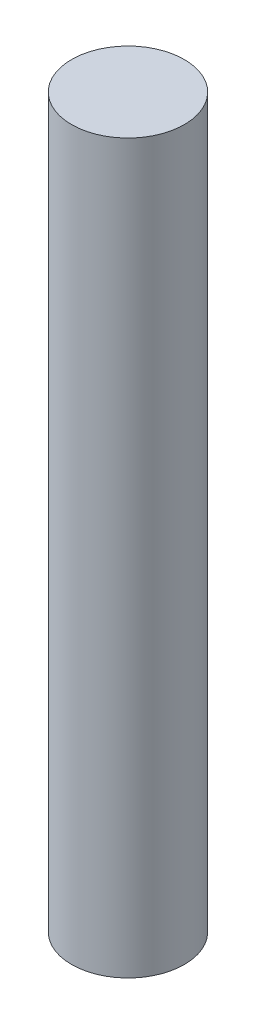
ISO-10303-21;
HEADER;
FILE_DESCRIPTION(('STEP AP214'),'2;1');
FILE_NAME('part.step','',(''),(''),'','','');
FILE_SCHEMA(('AUTOMOTIVE_DESIGN { 1 0 10303 214 1 1 1 1 }'));
ENDSEC;
DATA;
#1=APPLICATION_CONTEXT('core data for automotive mechanical design processes');
#2=APPLICATION_PROTOCOL_DEFINITION('international standard','automotive_design',2000,#1);
#3=PRODUCT_CONTEXT('',#1,'mechanical');
#4=PRODUCT('Part','Part','',(#3));
#5=PRODUCT_RELATED_PRODUCT_CATEGORY('part','',(#4));
#6=PRODUCT_DEFINITION_FORMATION('','',#4);
#7=PRODUCT_DEFINITION_CONTEXT('part definition',#1,'design');
#8=PRODUCT_DEFINITION('design','',#6,#7);
#9=PRODUCT_DEFINITION_SHAPE('','',#8);
#10=(LENGTH_UNIT() NAMED_UNIT(*) SI_UNIT(.MILLI.,.METRE.));
#11=(NAMED_UNIT(*) PLANE_ANGLE_UNIT() SI_UNIT($,.RADIAN.));
#12=(NAMED_UNIT(*) SI_UNIT($,.STERADIAN.) SOLID_ANGLE_UNIT());
#13=UNCERTAINTY_MEASURE_WITH_UNIT(LENGTH_MEASURE(1.E-05),#10,'distance_accuracy_value','');
#14=(GEOMETRIC_REPRESENTATION_CONTEXT(3) GLOBAL_UNCERTAINTY_ASSIGNED_CONTEXT((#13)) GLOBAL_UNIT_ASSIGNED_CONTEXT((#10,
#11,#12)) REPRESENTATION_CONTEXT('',''));
#15=CARTESIAN_POINT('',(0.,0.,0.));
#16=DIRECTION('',(0.,0.,1.));
#17=DIRECTION('',(1.,0.,0.));
#18=AXIS2_PLACEMENT_3D('',#15,#16,#17);
#19=CARTESIAN_POINT('',(0.,51.6,0.));
#20=DIRECTION('',(0.,-1.,0.));
#21=DIRECTION('',(0.,0.,-1.));
#22=AXIS2_PLACEMENT_3D('',#19,#20,#21);
#23=CYLINDRICAL_SURFACE('',#22,4.);
#24=CARTESIAN_POINT('',(0.,51.6,0.));
#25=DIRECTION('',(0.,1.,0.));
#26=DIRECTION('',(0.,0.,1.));
#27=AXIS2_PLACEMENT_3D('',#24,#25,#26);
#28=CIRCLE('',#27,4.);
#29=CARTESIAN_POINT('',(0.,51.6,4.));
#30=VERTEX_POINT('',#29);
#31=EDGE_CURVE('E10',#30,#30,#28,.T.);
#32=ORIENTED_EDGE('',*,*,#31,.F.);
#33=EDGE_LOOP('',(#32));
#34=FACE_BOUND('',#33,.T.);
#35=CARTESIAN_POINT('',(0.,0.,0.));
#36=DIRECTION('',(0.,1.,0.));
#37=DIRECTION('',(0.,0.,1.));
#38=AXIS2_PLACEMENT_3D('',#35,#36,#37);
#39=CIRCLE('',#38,4.);
#40=CARTESIAN_POINT('',(0.,0.,4.));
#41=VERTEX_POINT('',#40);
#42=EDGE_CURVE('E34',#41,#41,#39,.T.);
#43=ORIENTED_EDGE('',*,*,#42,.T.);
#44=EDGE_LOOP('',(#43));
#45=FACE_BOUND('',#44,.T.);
#46=ADVANCED_FACE('F31',(#34,#45),#23,.T.);
#47=CARTESIAN_POINT('',(0.,51.6,0.));
#48=DIRECTION('',(0.,1.,0.));
#49=DIRECTION('',(0.,0.,1.));
#50=AXIS2_PLACEMENT_3D('',#47,#48,#49);
#51=PLANE('',#50);
#52=ORIENTED_EDGE('',*,*,#31,.T.);
#53=EDGE_LOOP('',(#52));
#54=FACE_BOUND('',#53,.T.);
#55=ADVANCED_FACE('F46',(#54),#51,.T.);
#56=CARTESIAN_POINT('',(0.,0.,0.));
#57=DIRECTION('',(0.,1.,0.));
#58=DIRECTION('',(0.,0.,1.));
#59=AXIS2_PLACEMENT_3D('',#56,#57,#58);
#60=PLANE('',#59);
#61=ORIENTED_EDGE('',*,*,#42,.F.);
#62=EDGE_LOOP('',(#61));
#63=FACE_BOUND('',#62,.T.);
#64=ADVANCED_FACE('F44',(#63),#60,.F.);
#65=CLOSED_SHELL('',(#46,#55,#64));
#66=MANIFOLD_SOLID_BREP('B2',#65);
#67=ADVANCED_BREP_SHAPE_REPRESENTATION('',(#18,#66),#14);
#68=SHAPE_DEFINITION_REPRESENTATION(#9,#67);
ENDSEC;
END-ISO-10303-21;
